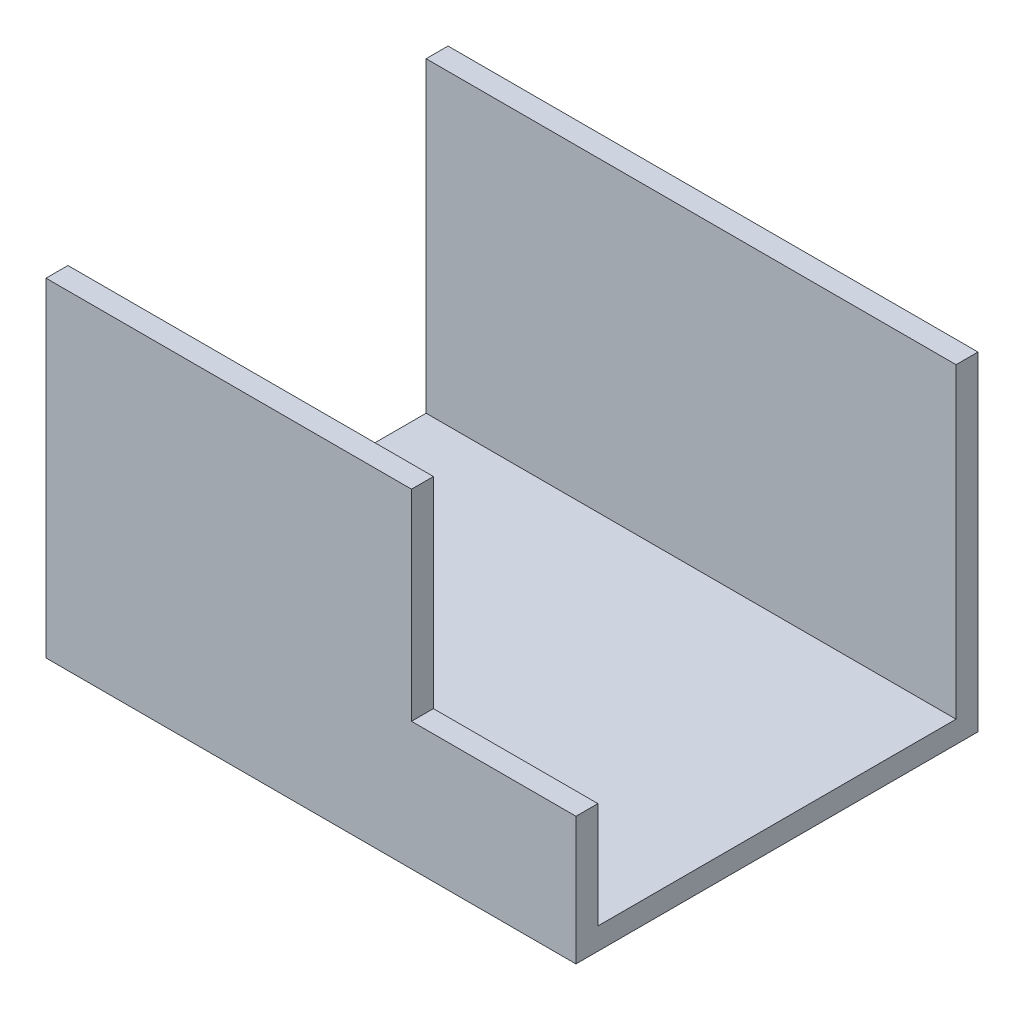
ISO-10303-21;
HEADER;
FILE_DESCRIPTION(('STEP AP214'),'2;1');
FILE_NAME('part.step','',(''),(''),'','','');
FILE_SCHEMA(('AUTOMOTIVE_DESIGN { 1 0 10303 214 1 1 1 1 }'));
ENDSEC;
DATA;
#1=APPLICATION_CONTEXT('core data for automotive mechanical design processes');
#2=APPLICATION_PROTOCOL_DEFINITION('international standard','automotive_design',2000,#1);
#3=PRODUCT_CONTEXT('',#1,'mechanical');
#4=PRODUCT('Part','Part','',(#3));
#5=PRODUCT_RELATED_PRODUCT_CATEGORY('part','',(#4));
#6=PRODUCT_DEFINITION_FORMATION('','',#4);
#7=PRODUCT_DEFINITION_CONTEXT('part definition',#1,'design');
#8=PRODUCT_DEFINITION('design','',#6,#7);
#9=PRODUCT_DEFINITION_SHAPE('','',#8);
#10=(LENGTH_UNIT() NAMED_UNIT(*) SI_UNIT(.MILLI.,.METRE.));
#11=(NAMED_UNIT(*) PLANE_ANGLE_UNIT() SI_UNIT($,.RADIAN.));
#12=(NAMED_UNIT(*) SI_UNIT($,.STERADIAN.) SOLID_ANGLE_UNIT());
#13=UNCERTAINTY_MEASURE_WITH_UNIT(LENGTH_MEASURE(1.E-05),#10,'distance_accuracy_value','');
#14=(GEOMETRIC_REPRESENTATION_CONTEXT(3) GLOBAL_UNCERTAINTY_ASSIGNED_CONTEXT((#13)) GLOBAL_UNIT_ASSIGNED_CONTEXT((#10,
#11,#12)) REPRESENTATION_CONTEXT('',''));
#15=CARTESIAN_POINT('',(0.,0.,0.));
#16=DIRECTION('',(0.,0.,1.));
#17=DIRECTION('',(1.,0.,0.));
#18=AXIS2_PLACEMENT_3D('',#15,#16,#17);
#19=CARTESIAN_POINT('',(2.75,0.005,0.));
#20=DIRECTION('',(0.,1.,0.));
#21=DIRECTION('',(0.707106781186548,0.,0.707106781186548));
#22=AXIS2_PLACEMENT_3D('',#19,#20,#21);
#23=PLANE('',#22);
#24=DIRECTION('',(0.,0.,1.));
#25=VECTOR('',#24,1.);
#26=CARTESIAN_POINT('',(2.25,0.005,0.03));
#27=LINE('',#26,#25);
#28=CARTESIAN_POINT('',(2.25,0.005,0.03));
#29=VERTEX_POINT('',#28);
#30=CARTESIAN_POINT('',(2.25,0.005,0.52));
#31=VERTEX_POINT('',#30);
#32=EDGE_CURVE('E11',#29,#31,#27,.T.);
#33=ORIENTED_EDGE('',*,*,#32,.T.);
#34=DIRECTION('',(-1.,0.,0.));
#35=VECTOR('',#34,1.);
#36=CARTESIAN_POINT('',(2.975,0.00500000000000012,0.52));
#37=LINE('',#36,#35);
#38=CARTESIAN_POINT('',(2.975,0.00500000000000011,0.52));
#39=VERTEX_POINT('',#38);
#40=EDGE_CURVE('E35',#39,#31,#37,.T.);
#41=ORIENTED_EDGE('',*,*,#40,.F.);
#42=DIRECTION('',(0.,0.,-1.));
#43=VECTOR('',#42,1.);
#44=CARTESIAN_POINT('',(2.975,0.005,0.52));
#45=LINE('',#44,#43);
#46=CARTESIAN_POINT('',(2.975,0.005,0.03));
#47=VERTEX_POINT('',#46);
#48=EDGE_CURVE('E26',#39,#47,#45,.T.);
#49=ORIENTED_EDGE('',*,*,#48,.T.);
#50=DIRECTION('',(-1.,0.,0.));
#51=VECTOR('',#50,1.);
#52=CARTESIAN_POINT('',(2.975,0.005,0.03));
#53=LINE('',#52,#51);
#54=EDGE_CURVE('E160',#47,#29,#53,.T.);
#55=ORIENTED_EDGE('',*,*,#54,.T.);
#56=EDGE_LOOP('',(#33,#41,#49,#55));
#57=FACE_BOUND('',#56,.T.);
#58=ADVANCED_FACE('F16',(#57),#23,.T.);
#59=CARTESIAN_POINT('',(2.6,0.,0.52));
#60=DIRECTION('',(0.,0.,-1.));
#61=DIRECTION('',(0.707106781186548,0.707106781186548,0.));
#62=AXIS2_PLACEMENT_3D('',#59,#60,#61);
#63=PLANE('',#62);
#64=DIRECTION('',(0.,-1.,0.));
#65=VECTOR('',#64,1.);
#66=CARTESIAN_POINT('',(2.75,0.425,0.52));
#67=LINE('',#66,#65);
#68=CARTESIAN_POINT('',(2.75,0.425,0.52));
#69=VERTEX_POINT('',#68);
#70=CARTESIAN_POINT('',(2.75,0.15,0.52));
#71=VERTEX_POINT('',#70);
#72=EDGE_CURVE('E111',#69,#71,#67,.T.);
#73=ORIENTED_EDGE('',*,*,#72,.T.);
#74=DIRECTION('',(1.,0.,0.));
#75=VECTOR('',#74,1.);
#76=CARTESIAN_POINT('',(2.75,0.15,0.52));
#77=LINE('',#76,#75);
#78=CARTESIAN_POINT('',(2.975,0.15,0.52));
#79=VERTEX_POINT('',#78);
#80=EDGE_CURVE('E156',#71,#79,#77,.T.);
#81=ORIENTED_EDGE('',*,*,#80,.T.);
#82=DIRECTION('',(0.,-1.,0.));
#83=VECTOR('',#82,1.);
#84=CARTESIAN_POINT('',(2.975,0.15,0.52));
#85=LINE('',#84,#83);
#86=EDGE_CURVE('E152',#79,#39,#85,.T.);
#87=ORIENTED_EDGE('',*,*,#86,.T.);
#88=ORIENTED_EDGE('',*,*,#40,.T.);
#89=DIRECTION('',(0.,1.,0.));
#90=VECTOR('',#89,1.);
#91=CARTESIAN_POINT('',(2.25,0.005,0.52));
#92=LINE('',#91,#90);
#93=CARTESIAN_POINT('',(2.25,0.425,0.52));
#94=VERTEX_POINT('',#93);
#95=EDGE_CURVE('E164',#31,#94,#92,.T.);
#96=ORIENTED_EDGE('',*,*,#95,.T.);
#97=DIRECTION('',(1.,0.,0.));
#98=VECTOR('',#97,1.);
#99=CARTESIAN_POINT('',(2.25,0.425,0.52));
#100=LINE('',#99,#98);
#101=EDGE_CURVE('E166',#94,#69,#100,.T.);
#102=ORIENTED_EDGE('',*,*,#101,.T.);
#103=EDGE_LOOP('',(#73,#81,#87,#88,#96,#102));
#104=FACE_BOUND('',#103,.T.);
#105=ADVANCED_FACE('F158',(#104),#63,.T.);
#106=CARTESIAN_POINT('',(2.6,0.,0.03));
#107=DIRECTION('',(0.,0.,-1.));
#108=DIRECTION('',(0.707106781186548,0.707106781186548,0.));
#109=AXIS2_PLACEMENT_3D('',#106,#107,#108);
#110=PLANE('',#109);
#111=ORIENTED_EDGE('',*,*,#54,.F.);
#112=DIRECTION('',(0.,1.,0.));
#113=VECTOR('',#112,1.);
#114=CARTESIAN_POINT('',(2.975,0.005,0.03));
#115=LINE('',#114,#113);
#116=CARTESIAN_POINT('',(2.975,0.425,0.03));
#117=VERTEX_POINT('',#116);
#118=EDGE_CURVE('E168',#47,#117,#115,.T.);
#119=ORIENTED_EDGE('',*,*,#118,.T.);
#120=DIRECTION('',(1.,0.,0.));
#121=VECTOR('',#120,1.);
#122=CARTESIAN_POINT('',(2.25,0.425,0.03));
#123=LINE('',#122,#121);
#124=CARTESIAN_POINT('',(2.25,0.425,0.03));
#125=VERTEX_POINT('',#124);
#126=EDGE_CURVE('E172',#125,#117,#123,.T.);
#127=ORIENTED_EDGE('',*,*,#126,.F.);
#128=DIRECTION('',(0.,1.,0.));
#129=VECTOR('',#128,1.);
#130=CARTESIAN_POINT('',(2.25,0.005,0.03));
#131=LINE('',#130,#129);
#132=EDGE_CURVE('E130',#29,#125,#131,.T.);
#133=ORIENTED_EDGE('',*,*,#132,.F.);
#134=EDGE_LOOP('',(#111,#119,#127,#133));
#135=FACE_BOUND('',#134,.T.);
#136=ADVANCED_FACE('F192',(#135),#110,.F.);
#137=CARTESIAN_POINT('',(2.25,0.425,0.));
#138=DIRECTION('',(0.,-1.,0.));
#139=DIRECTION('',(0.707106781186548,0.,0.707106781186548));
#140=AXIS2_PLACEMENT_3D('',#137,#138,#139);
#141=PLANE('',#140);
#142=DIRECTION('',(0.,0.,-1.));
#143=VECTOR('',#142,1.);
#144=CARTESIAN_POINT('',(2.975,0.425,0.03));
#145=LINE('',#144,#143);
#146=CARTESIAN_POINT('',(2.975,0.425,0.));
#147=VERTEX_POINT('',#146);
#148=EDGE_CURVE('E171',#117,#147,#145,.T.);
#149=ORIENTED_EDGE('',*,*,#148,.T.);
#150=DIRECTION('',(1.,0.,0.));
#151=VECTOR('',#150,1.);
#152=CARTESIAN_POINT('',(2.25,0.425,0.));
#153=LINE('',#152,#151);
#154=CARTESIAN_POINT('',(2.25,0.425,0.));
#155=VERTEX_POINT('',#154);
#156=EDGE_CURVE('E174',#155,#147,#153,.T.);
#157=ORIENTED_EDGE('',*,*,#156,.F.);
#158=DIRECTION('',(0.,0.,1.));
#159=VECTOR('',#158,1.);
#160=CARTESIAN_POINT('',(2.25,0.425,0.));
#161=LINE('',#160,#159);
#162=EDGE_CURVE('E173',#155,#125,#161,.T.);
#163=ORIENTED_EDGE('',*,*,#162,.T.);
#164=ORIENTED_EDGE('',*,*,#126,.T.);
#165=EDGE_LOOP('',(#149,#157,#163,#164));
#166=FACE_BOUND('',#165,.T.);
#167=ADVANCED_FACE('F190',(#166),#141,.F.);
#168=CARTESIAN_POINT('',(2.6,0.,0.));
#169=DIRECTION('',(0.,0.,-1.));
#170=DIRECTION('',(0.707106781186548,0.707106781186548,0.));
#171=AXIS2_PLACEMENT_3D('',#168,#169,#170);
#172=PLANE('',#171);
#173=ORIENTED_EDGE('',*,*,#156,.T.);
#174=DIRECTION('',(0.,-1.,0.));
#175=VECTOR('',#174,1.);
#176=CARTESIAN_POINT('',(2.975,0.425,0.));
#177=LINE('',#176,#175);
#178=CARTESIAN_POINT('',(2.975,-0.025,0.));
#179=VERTEX_POINT('',#178);
#180=EDGE_CURVE('E151',#147,#179,#177,.T.);
#181=ORIENTED_EDGE('',*,*,#180,.T.);
#182=DIRECTION('',(-1.,0.,0.));
#183=VECTOR('',#182,1.);
#184=CARTESIAN_POINT('',(2.975,-0.025,0.));
#185=LINE('',#184,#183);
#186=CARTESIAN_POINT('',(2.25,-0.025,0.));
#187=VERTEX_POINT('',#186);
#188=EDGE_CURVE('E143',#179,#187,#185,.T.);
#189=ORIENTED_EDGE('',*,*,#188,.T.);
#190=DIRECTION('',(0.,1.,0.));
#191=VECTOR('',#190,1.);
#192=CARTESIAN_POINT('',(2.25,-0.025,0.));
#193=LINE('',#192,#191);
#194=EDGE_CURVE('E134',#187,#155,#193,.T.);
#195=ORIENTED_EDGE('',*,*,#194,.T.);
#196=EDGE_LOOP('',(#173,#181,#189,#195));
#197=FACE_BOUND('',#196,.T.);
#198=ADVANCED_FACE('F183',(#197),#172,.T.);
#199=CARTESIAN_POINT('',(2.6,0.,0.55));
#200=DIRECTION('',(0.,0.,-1.));
#201=DIRECTION('',(0.707106781186548,0.707106781186548,0.));
#202=AXIS2_PLACEMENT_3D('',#199,#200,#201);
#203=PLANE('',#202);
#204=DIRECTION('',(0.,1.,0.));
#205=VECTOR('',#204,1.);
#206=CARTESIAN_POINT('',(2.25,-0.025,0.55));
#207=LINE('',#206,#205);
#208=CARTESIAN_POINT('',(2.25,-0.025,0.55));
#209=VERTEX_POINT('',#208);
#210=CARTESIAN_POINT('',(2.25,0.425,0.55));
#211=VERTEX_POINT('',#210);
#212=EDGE_CURVE('E127',#209,#211,#207,.T.);
#213=ORIENTED_EDGE('',*,*,#212,.F.);
#214=DIRECTION('',(-1.,0.,0.));
#215=VECTOR('',#214,1.);
#216=CARTESIAN_POINT('',(2.975,-0.025,0.55));
#217=LINE('',#216,#215);
#218=CARTESIAN_POINT('',(2.975,-0.025,0.55));
#219=VERTEX_POINT('',#218);
#220=EDGE_CURVE('E112',#219,#209,#217,.T.);
#221=ORIENTED_EDGE('',*,*,#220,.F.);
#222=DIRECTION('',(0.,1.,0.));
#223=VECTOR('',#222,1.);
#224=CARTESIAN_POINT('',(2.975,-0.025,0.55));
#225=LINE('',#224,#223);
#226=CARTESIAN_POINT('',(2.975,0.15,0.55));
#227=VERTEX_POINT('',#226);
#228=EDGE_CURVE('E137',#219,#227,#225,.T.);
#229=ORIENTED_EDGE('',*,*,#228,.T.);
#230=DIRECTION('',(1.,0.,0.));
#231=VECTOR('',#230,1.);
#232=CARTESIAN_POINT('',(2.75,0.15,0.55));
#233=LINE('',#232,#231);
#234=CARTESIAN_POINT('',(2.75,0.15,0.55));
#235=VERTEX_POINT('',#234);
#236=EDGE_CURVE('E89',#235,#227,#233,.T.);
#237=ORIENTED_EDGE('',*,*,#236,.F.);
#238=DIRECTION('',(0.,-1.,0.));
#239=VECTOR('',#238,1.);
#240=CARTESIAN_POINT('',(2.75,0.425,0.55));
#241=LINE('',#240,#239);
#242=CARTESIAN_POINT('',(2.75,0.425,0.55));
#243=VERTEX_POINT('',#242);
#244=EDGE_CURVE('E101',#243,#235,#241,.T.);
#245=ORIENTED_EDGE('',*,*,#244,.F.);
#246=DIRECTION('',(1.,0.,0.));
#247=VECTOR('',#246,1.);
#248=CARTESIAN_POINT('',(2.25,0.425,0.55));
#249=LINE('',#248,#247);
#250=EDGE_CURVE('E95',#211,#243,#249,.T.);
#251=ORIENTED_EDGE('',*,*,#250,.F.);
#252=EDGE_LOOP('',(#213,#221,#229,#237,#245,#251));
#253=FACE_BOUND('',#252,.T.);
#254=ADVANCED_FACE('F102',(#253),#203,.F.);
#255=CARTESIAN_POINT('',(2.75,-0.025,0.));
#256=DIRECTION('',(0.,1.,0.));
#257=DIRECTION('',(0.707106781186548,0.,0.707106781186548));
#258=AXIS2_PLACEMENT_3D('',#255,#256,#257);
#259=PLANE('',#258);
#260=DIRECTION('',(0.,0.,1.));
#261=VECTOR('',#260,1.);
#262=CARTESIAN_POINT('',(2.975,-0.025,0.));
#263=LINE('',#262,#261);
#264=EDGE_CURVE('E115',#179,#219,#263,.T.);
#265=ORIENTED_EDGE('',*,*,#264,.T.);
#266=ORIENTED_EDGE('',*,*,#220,.T.);
#267=DIRECTION('',(0.,0.,1.));
#268=VECTOR('',#267,1.);
#269=CARTESIAN_POINT('',(2.25,-0.025,0.));
#270=LINE('',#269,#268);
#271=EDGE_CURVE('E119',#187,#209,#270,.T.);
#272=ORIENTED_EDGE('',*,*,#271,.F.);
#273=ORIENTED_EDGE('',*,*,#188,.F.);
#274=EDGE_LOOP('',(#265,#266,#272,#273));
#275=FACE_BOUND('',#274,.T.);
#276=ADVANCED_FACE('F141',(#275),#259,.F.);
#277=CARTESIAN_POINT('',(2.75,0.425,0.));
#278=DIRECTION('',(-1.,0.,0.));
#279=DIRECTION('',(0.,0.707106781186548,0.707106781186548));
#280=AXIS2_PLACEMENT_3D('',#277,#278,#279);
#281=PLANE('',#280);
#282=ORIENTED_EDGE('',*,*,#72,.F.);
#283=DIRECTION('',(0.,0.,1.));
#284=VECTOR('',#283,1.);
#285=CARTESIAN_POINT('',(2.75,0.425,0.52));
#286=LINE('',#285,#284);
#287=EDGE_CURVE('E97',#69,#243,#286,.T.);
#288=ORIENTED_EDGE('',*,*,#287,.T.);
#289=ORIENTED_EDGE('',*,*,#244,.T.);
#290=DIRECTION('',(0.,0.,-1.));
#291=VECTOR('',#290,1.);
#292=CARTESIAN_POINT('',(2.75,0.15,0.55));
#293=LINE('',#292,#291);
#294=EDGE_CURVE('E106',#235,#71,#293,.T.);
#295=ORIENTED_EDGE('',*,*,#294,.T.);
#296=EDGE_LOOP('',(#282,#288,#289,#295));
#297=FACE_BOUND('',#296,.T.);
#298=ADVANCED_FACE('F109',(#297),#281,.F.);
#299=CARTESIAN_POINT('',(2.75,0.15,0.55));
#300=DIRECTION('',(0.,-1.,0.));
#301=DIRECTION('',(0.707106781186548,0.,0.707106781186548));
#302=AXIS2_PLACEMENT_3D('',#299,#300,#301);
#303=PLANE('',#302);
#304=ORIENTED_EDGE('',*,*,#236,.T.);
#305=DIRECTION('',(0.,0.,-1.));
#306=VECTOR('',#305,1.);
#307=CARTESIAN_POINT('',(2.975,0.15,0.55));
#308=LINE('',#307,#306);
#309=EDGE_CURVE('E121',#227,#79,#308,.T.);
#310=ORIENTED_EDGE('',*,*,#309,.T.);
#311=ORIENTED_EDGE('',*,*,#80,.F.);
#312=ORIENTED_EDGE('',*,*,#294,.F.);
#313=EDGE_LOOP('',(#304,#310,#311,#312));
#314=FACE_BOUND('',#313,.T.);
#315=ADVANCED_FACE('F218',(#314),#303,.F.);
#316=CARTESIAN_POINT('',(2.975,0.,0.));
#317=DIRECTION('',(-1.,0.,0.));
#318=DIRECTION('',(0.,0.707106781186548,0.707106781186548));
#319=AXIS2_PLACEMENT_3D('',#316,#317,#318);
#320=PLANE('',#319);
#321=ORIENTED_EDGE('',*,*,#48,.F.);
#322=ORIENTED_EDGE('',*,*,#86,.F.);
#323=ORIENTED_EDGE('',*,*,#309,.F.);
#324=ORIENTED_EDGE('',*,*,#228,.F.);
#325=ORIENTED_EDGE('',*,*,#264,.F.);
#326=ORIENTED_EDGE('',*,*,#180,.F.);
#327=ORIENTED_EDGE('',*,*,#148,.F.);
#328=ORIENTED_EDGE('',*,*,#118,.F.);
#329=EDGE_LOOP('',(#321,#322,#323,#324,#325,#326,#327,#328));
#330=FACE_BOUND('',#329,.T.);
#331=ADVANCED_FACE('F149',(#330),#320,.F.);
#332=CARTESIAN_POINT('',(2.25,-0.025,0.));
#333=DIRECTION('',(1.,0.,0.));
#334=DIRECTION('',(0.,0.707106781186548,0.707106781186548));
#335=AXIS2_PLACEMENT_3D('',#332,#333,#334);
#336=PLANE('',#335);
#337=ORIENTED_EDGE('',*,*,#162,.F.);
#338=ORIENTED_EDGE('',*,*,#194,.F.);
#339=ORIENTED_EDGE('',*,*,#271,.T.);
#340=ORIENTED_EDGE('',*,*,#212,.T.);
#341=DIRECTION('',(0.,0.,1.));
#342=VECTOR('',#341,1.);
#343=CARTESIAN_POINT('',(2.25,0.425,0.52));
#344=LINE('',#343,#342);
#345=EDGE_CURVE('E20',#94,#211,#344,.T.);
#346=ORIENTED_EDGE('',*,*,#345,.F.);
#347=ORIENTED_EDGE('',*,*,#95,.F.);
#348=ORIENTED_EDGE('',*,*,#32,.F.);
#349=ORIENTED_EDGE('',*,*,#132,.T.);
#350=EDGE_LOOP('',(#337,#338,#339,#340,#346,#347,#348,#349));
#351=FACE_BOUND('',#350,.T.);
#352=ADVANCED_FACE('F185',(#351),#336,.F.);
#353=CARTESIAN_POINT('',(2.25,0.425,0.));
#354=DIRECTION('',(0.,-1.,0.));
#355=DIRECTION('',(0.707106781186548,0.,0.707106781186548));
#356=AXIS2_PLACEMENT_3D('',#353,#354,#355);
#357=PLANE('',#356);
#358=ORIENTED_EDGE('',*,*,#345,.T.);
#359=ORIENTED_EDGE('',*,*,#250,.T.);
#360=ORIENTED_EDGE('',*,*,#287,.F.);
#361=ORIENTED_EDGE('',*,*,#101,.F.);
#362=EDGE_LOOP('',(#358,#359,#360,#361));
#363=FACE_BOUND('',#362,.T.);
#364=ADVANCED_FACE('F18',(#363),#357,.F.);
#365=CLOSED_SHELL('',(#58,#105,#136,#167,#198,#254,#276,#298,#315,#331,#352,#364));
#366=MANIFOLD_SOLID_BREP('B1',#365);
#367=ADVANCED_BREP_SHAPE_REPRESENTATION('',(#18,#366),#14);
#368=SHAPE_DEFINITION_REPRESENTATION(#9,#367);
ENDSEC;
END-ISO-10303-21;
